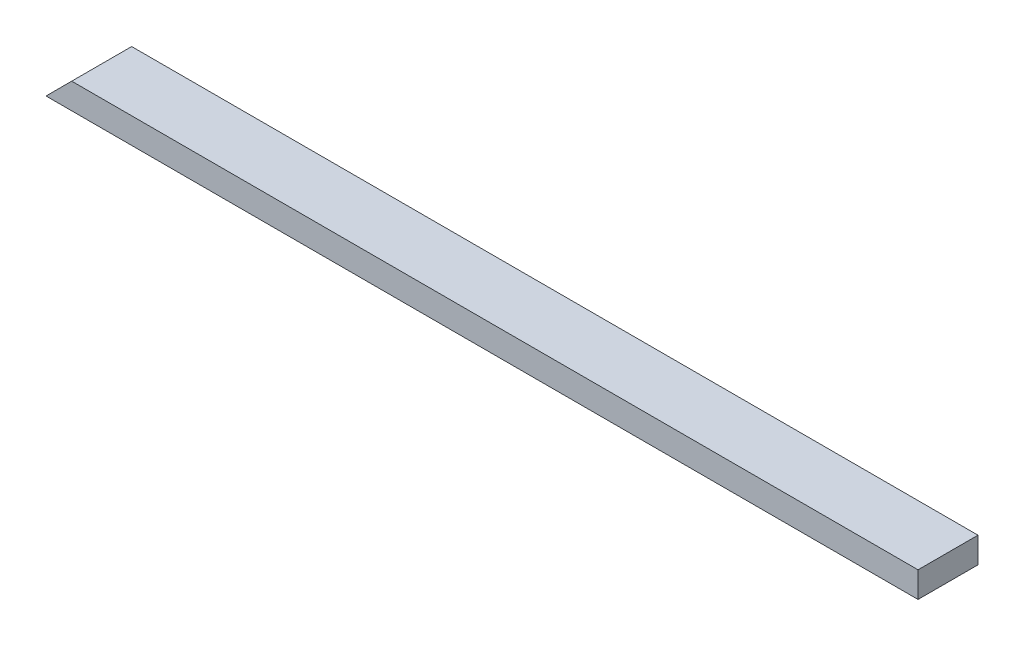
ISO-10303-21;
HEADER;
FILE_DESCRIPTION(('STEP AP214'),'2;1');
FILE_NAME('part.step','',(''),(''),'','','');
FILE_SCHEMA(('AUTOMOTIVE_DESIGN { 1 0 10303 214 1 1 1 1 }'));
ENDSEC;
DATA;
#1=APPLICATION_CONTEXT('core data for automotive mechanical design processes');
#2=APPLICATION_PROTOCOL_DEFINITION('international standard','automotive_design',2000,#1);
#3=PRODUCT_CONTEXT('',#1,'mechanical');
#4=PRODUCT('Part','Part','',(#3));
#5=PRODUCT_RELATED_PRODUCT_CATEGORY('part','',(#4));
#6=PRODUCT_DEFINITION_FORMATION('','',#4);
#7=PRODUCT_DEFINITION_CONTEXT('part definition',#1,'design');
#8=PRODUCT_DEFINITION('design','',#6,#7);
#9=PRODUCT_DEFINITION_SHAPE('','',#8);
#10=(LENGTH_UNIT() NAMED_UNIT(*) SI_UNIT(.MILLI.,.METRE.));
#11=(NAMED_UNIT(*) PLANE_ANGLE_UNIT() SI_UNIT($,.RADIAN.));
#12=(NAMED_UNIT(*) SI_UNIT($,.STERADIAN.) SOLID_ANGLE_UNIT());
#13=UNCERTAINTY_MEASURE_WITH_UNIT(LENGTH_MEASURE(1.E-05),#10,'distance_accuracy_value','');
#14=(GEOMETRIC_REPRESENTATION_CONTEXT(3) GLOBAL_UNCERTAINTY_ASSIGNED_CONTEXT((#13)) GLOBAL_UNIT_ASSIGNED_CONTEXT((#10,
#11,#12)) REPRESENTATION_CONTEXT('',''));
#15=CARTESIAN_POINT('',(0.,0.,0.));
#16=DIRECTION('',(0.,0.,1.));
#17=DIRECTION('',(1.,0.,0.));
#18=AXIS2_PLACEMENT_3D('',#15,#16,#17);
#19=CARTESIAN_POINT('',(0.,38.1,0.));
#20=DIRECTION('',(0.,0.,-1.));
#21=DIRECTION('',(-1.,0.,0.));
#22=AXIS2_PLACEMENT_3D('',#19,#20,#21);
#23=PLANE('',#22);
#24=DIRECTION('',(1.,0.,0.));
#25=VECTOR('',#24,1.);
#26=CARTESIAN_POINT('',(0.,38.1,0.));
#27=LINE('',#26,#25);
#28=CARTESIAN_POINT('',(38.1,38.1,0.));
#29=VERTEX_POINT('',#28);
#30=CARTESIAN_POINT('',(1292.8727,38.1,0.));
#31=VERTEX_POINT('',#30);
#32=EDGE_CURVE('E92',#29,#31,#27,.T.);
#33=ORIENTED_EDGE('',*,*,#32,.F.);
#34=DIRECTION('',(0.707106781186547,0.707106781186547,0.));
#35=VECTOR('',#34,1.);
#36=CARTESIAN_POINT('',(0.,0.,0.));
#37=LINE('',#36,#35);
#38=CARTESIAN_POINT('',(0.,0.,0.));
#39=VERTEX_POINT('',#38);
#40=EDGE_CURVE('E86',#39,#29,#37,.T.);
#41=ORIENTED_EDGE('',*,*,#40,.F.);
#42=DIRECTION('',(1.,0.,0.));
#43=VECTOR('',#42,1.);
#44=CARTESIAN_POINT('',(0.,0.,0.));
#45=LINE('',#44,#43);
#46=CARTESIAN_POINT('',(1292.8727,0.,0.));
#47=VERTEX_POINT('',#46);
#48=EDGE_CURVE('E96',#39,#47,#45,.T.);
#49=ORIENTED_EDGE('',*,*,#48,.T.);
#50=DIRECTION('',(0.,-1.,0.));
#51=VECTOR('',#50,1.);
#52=CARTESIAN_POINT('',(1292.8727,38.1,0.));
#53=LINE('',#52,#51);
#54=EDGE_CURVE('E11',#31,#47,#53,.T.);
#55=ORIENTED_EDGE('',*,*,#54,.F.);
#56=EDGE_LOOP('',(#33,#41,#49,#55));
#57=FACE_BOUND('',#56,.T.);
#58=ADVANCED_FACE('F39',(#57),#23,.F.);
#59=CARTESIAN_POINT('',(1292.8727,38.1,0.));
#60=DIRECTION('',(-1.,0.,0.));
#61=DIRECTION('',(0.,0.,1.));
#62=AXIS2_PLACEMENT_3D('',#59,#60,#61);
#63=PLANE('',#62);
#64=DIRECTION('',(0.,0.,-1.));
#65=VECTOR('',#64,1.);
#66=CARTESIAN_POINT('',(1292.8727,0.,0.));
#67=LINE('',#66,#65);
#68=CARTESIAN_POINT('',(1292.8727,0.,-88.9));
#69=VERTEX_POINT('',#68);
#70=EDGE_CURVE('E67',#47,#69,#67,.T.);
#71=ORIENTED_EDGE('',*,*,#70,.T.);
#72=DIRECTION('',(0.,-1.,0.));
#73=VECTOR('',#72,1.);
#74=CARTESIAN_POINT('',(1292.8727,38.1,-88.9));
#75=LINE('',#74,#73);
#76=CARTESIAN_POINT('',(1292.8727,38.1,-88.9));
#77=VERTEX_POINT('',#76);
#78=EDGE_CURVE('E47',#77,#69,#75,.T.);
#79=ORIENTED_EDGE('',*,*,#78,.F.);
#80=DIRECTION('',(0.,0.,-1.));
#81=VECTOR('',#80,1.);
#82=CARTESIAN_POINT('',(1292.8727,38.1,0.));
#83=LINE('',#82,#81);
#84=EDGE_CURVE('E55',#31,#77,#83,.T.);
#85=ORIENTED_EDGE('',*,*,#84,.F.);
#86=ORIENTED_EDGE('',*,*,#54,.T.);
#87=EDGE_LOOP('',(#71,#79,#85,#86));
#88=FACE_BOUND('',#87,.T.);
#89=ADVANCED_FACE('F111',(#88),#63,.F.);
#90=CARTESIAN_POINT('',(0.,38.1,-88.9));
#91=DIRECTION('',(0.,0.,1.));
#92=DIRECTION('',(1.,0.,0.));
#93=AXIS2_PLACEMENT_3D('',#90,#91,#92);
#94=PLANE('',#93);
#95=DIRECTION('',(-1.,0.,0.));
#96=VECTOR('',#95,1.);
#97=CARTESIAN_POINT('',(0.,0.,-88.9));
#98=LINE('',#97,#96);
#99=CARTESIAN_POINT('',(0.,0.,-88.9));
#100=VERTEX_POINT('',#99);
#101=EDGE_CURVE('E89',#69,#100,#98,.T.);
#102=ORIENTED_EDGE('',*,*,#101,.T.);
#103=DIRECTION('',(0.707106781186547,0.707106781186547,0.));
#104=VECTOR('',#103,1.);
#105=CARTESIAN_POINT('',(0.,0.,-88.9));
#106=LINE('',#105,#104);
#107=CARTESIAN_POINT('',(38.1,38.1,-88.9));
#108=VERTEX_POINT('',#107);
#109=EDGE_CURVE('E74',#100,#108,#106,.T.);
#110=ORIENTED_EDGE('',*,*,#109,.T.);
#111=DIRECTION('',(-1.,0.,0.));
#112=VECTOR('',#111,1.);
#113=CARTESIAN_POINT('',(0.,38.1,-88.9));
#114=LINE('',#113,#112);
#115=EDGE_CURVE('E101',#77,#108,#114,.T.);
#116=ORIENTED_EDGE('',*,*,#115,.F.);
#117=ORIENTED_EDGE('',*,*,#78,.T.);
#118=EDGE_LOOP('',(#102,#110,#116,#117));
#119=FACE_BOUND('',#118,.T.);
#120=ADVANCED_FACE('F90',(#119),#94,.F.);
#121=CARTESIAN_POINT('',(0.,38.1,0.));
#122=DIRECTION('',(0.,-1.,0.));
#123=DIRECTION('',(0.,0.,-1.));
#124=AXIS2_PLACEMENT_3D('',#121,#122,#123);
#125=PLANE('',#124);
#126=ORIENTED_EDGE('',*,*,#115,.T.);
#127=DIRECTION('',(0.,0.,1.));
#128=VECTOR('',#127,1.);
#129=CARTESIAN_POINT('',(38.1,38.1,-88.9));
#130=LINE('',#129,#128);
#131=EDGE_CURVE('E83',#108,#29,#130,.T.);
#132=ORIENTED_EDGE('',*,*,#131,.T.);
#133=ORIENTED_EDGE('',*,*,#32,.T.);
#134=ORIENTED_EDGE('',*,*,#84,.T.);
#135=EDGE_LOOP('',(#126,#132,#133,#134));
#136=FACE_BOUND('',#135,.T.);
#137=ADVANCED_FACE('F109',(#136),#125,.F.);
#138=CARTESIAN_POINT('',(0.,0.,0.));
#139=DIRECTION('',(0.,-1.,0.));
#140=DIRECTION('',(0.,0.,-1.));
#141=AXIS2_PLACEMENT_3D('',#138,#139,#140);
#142=PLANE('',#141);
#143=DIRECTION('',(0.,0.,1.));
#144=VECTOR('',#143,1.);
#145=CARTESIAN_POINT('',(0.,0.,0.));
#146=LINE('',#145,#144);
#147=EDGE_CURVE('E80',#100,#39,#146,.T.);
#148=ORIENTED_EDGE('',*,*,#147,.F.);
#149=ORIENTED_EDGE('',*,*,#101,.F.);
#150=ORIENTED_EDGE('',*,*,#70,.F.);
#151=ORIENTED_EDGE('',*,*,#48,.F.);
#152=EDGE_LOOP('',(#148,#149,#150,#151));
#153=FACE_BOUND('',#152,.T.);
#154=ADVANCED_FACE('F95',(#153),#142,.T.);
#155=CARTESIAN_POINT('',(0.,0.,-88.9));
#156=DIRECTION('',(0.707106781186547,-0.707106781186547,0.));
#157=DIRECTION('',(0.707106781186548,0.707106781186548,0.));
#158=AXIS2_PLACEMENT_3D('',#155,#156,#157);
#159=PLANE('',#158);
#160=ORIENTED_EDGE('',*,*,#40,.T.);
#161=ORIENTED_EDGE('',*,*,#131,.F.);
#162=ORIENTED_EDGE('',*,*,#109,.F.);
#163=ORIENTED_EDGE('',*,*,#147,.T.);
#164=EDGE_LOOP('',(#160,#161,#162,#163));
#165=FACE_BOUND('',#164,.T.);
#166=ADVANCED_FACE('F77',(#165),#159,.F.);
#167=CLOSED_SHELL('',(#58,#89,#120,#137,#154,#166));
#168=MANIFOLD_SOLID_BREP('B2',#167);
#169=ADVANCED_BREP_SHAPE_REPRESENTATION('',(#18,#168),#14);
#170=SHAPE_DEFINITION_REPRESENTATION(#9,#169);
ENDSEC;
END-ISO-10303-21;
